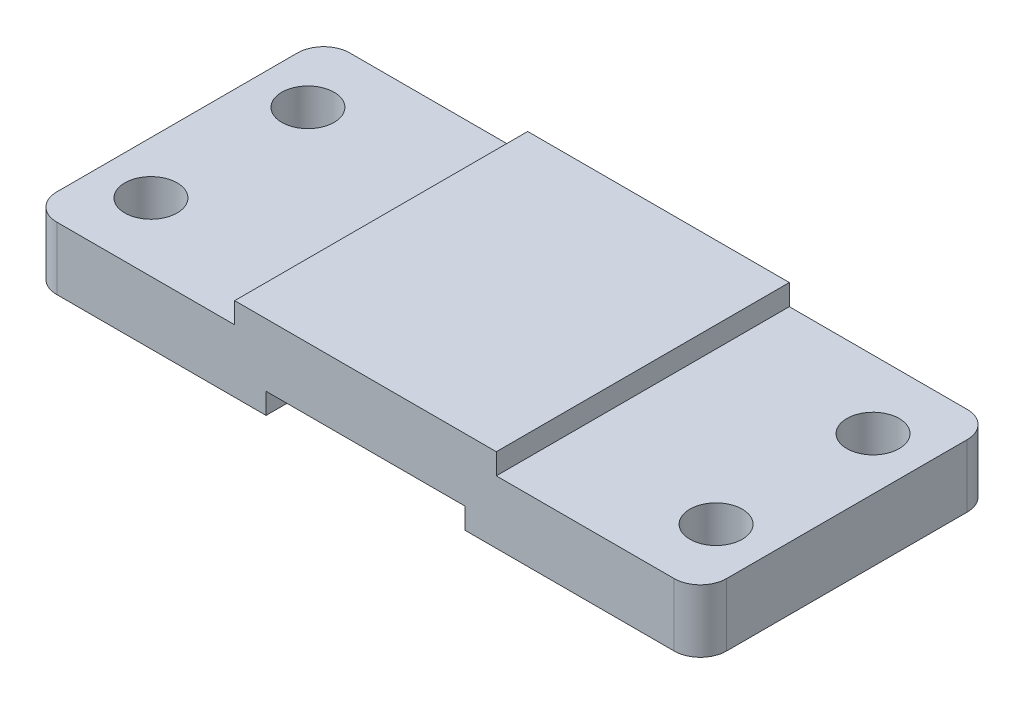
ISO-10303-21;
HEADER;
FILE_DESCRIPTION(('STEP AP214'),'2;1');
FILE_NAME('part.step','',(''),(''),'','','');
FILE_SCHEMA(('AUTOMOTIVE_DESIGN { 1 0 10303 214 1 1 1 1 }'));
ENDSEC;
DATA;
#1=APPLICATION_CONTEXT('core data for automotive mechanical design processes');
#2=APPLICATION_PROTOCOL_DEFINITION('international standard','automotive_design',2000,#1);
#3=PRODUCT_CONTEXT('',#1,'mechanical');
#4=PRODUCT('Part','Part','',(#3));
#5=PRODUCT_RELATED_PRODUCT_CATEGORY('part','',(#4));
#6=PRODUCT_DEFINITION_FORMATION('','',#4);
#7=PRODUCT_DEFINITION_CONTEXT('part definition',#1,'design');
#8=PRODUCT_DEFINITION('design','',#6,#7);
#9=PRODUCT_DEFINITION_SHAPE('','',#8);
#10=(LENGTH_UNIT() NAMED_UNIT(*) SI_UNIT(.MILLI.,.METRE.));
#11=(NAMED_UNIT(*) PLANE_ANGLE_UNIT() SI_UNIT($,.RADIAN.));
#12=(NAMED_UNIT(*) SI_UNIT($,.STERADIAN.) SOLID_ANGLE_UNIT());
#13=UNCERTAINTY_MEASURE_WITH_UNIT(LENGTH_MEASURE(1.E-05),#10,'distance_accuracy_value','');
#14=(GEOMETRIC_REPRESENTATION_CONTEXT(3) GLOBAL_UNCERTAINTY_ASSIGNED_CONTEXT((#13)) GLOBAL_UNIT_ASSIGNED_CONTEXT((#10,
#11,#12)) REPRESENTATION_CONTEXT('',''));
#15=CARTESIAN_POINT('',(0.,0.,0.));
#16=DIRECTION('',(0.,0.,1.));
#17=DIRECTION('',(1.,0.,0.));
#18=AXIS2_PLACEMENT_3D('',#15,#16,#17);
#19=CARTESIAN_POINT('',(-58.0024813895782,12.,-24.9032258064516));
#20=DIRECTION('',(1.,0.,0.));
#21=DIRECTION('',(0.,0.,-1.));
#22=AXIS2_PLACEMENT_3D('',#19,#20,#21);
#23=PLANE('',#22);
#24=DIRECTION('',(0.,1.,0.));
#25=VECTOR('',#24,1.);
#26=CARTESIAN_POINT('',(-58.0024813895782,-44.,26.0967741935484));
#27=LINE('',#26,#25);
#28=CARTESIAN_POINT('',(-58.0024813895782,0.,26.0967741935484));
#29=VERTEX_POINT('',#28);
#30=CARTESIAN_POINT('',(-58.0024813895782,12.,26.0967741935484));
#31=VERTEX_POINT('',#30);
#32=EDGE_CURVE('E169',#29,#31,#27,.T.);
#33=ORIENTED_EDGE('',*,*,#32,.T.);
#34=DIRECTION('',(0.,0.,1.));
#35=VECTOR('',#34,1.);
#36=CARTESIAN_POINT('',(-58.0024813895782,12.,-24.9032258064516));
#37=LINE('',#36,#35);
#38=CARTESIAN_POINT('',(-58.0024813895782,12.,-19.9032258064516));
#39=VERTEX_POINT('',#38);
#40=EDGE_CURVE('E165',#39,#31,#37,.T.);
#41=ORIENTED_EDGE('',*,*,#40,.F.);
#42=DIRECTION('',(0.,1.,0.));
#43=VECTOR('',#42,1.);
#44=CARTESIAN_POINT('',(-58.0024813895782,-44.,-19.9032258064516));
#45=LINE('',#44,#43);
#46=CARTESIAN_POINT('',(-58.0024813895782,0.,-19.9032258064516));
#47=VERTEX_POINT('',#46);
#48=EDGE_CURVE('E149',#47,#39,#45,.T.);
#49=ORIENTED_EDGE('',*,*,#48,.F.);
#50=DIRECTION('',(0.,0.,1.));
#51=VECTOR('',#50,1.);
#52=CARTESIAN_POINT('',(-58.0024813895782,0.,-24.9032258064516));
#53=LINE('',#52,#51);
#54=EDGE_CURVE('E190',#47,#29,#53,.T.);
#55=ORIENTED_EDGE('',*,*,#54,.T.);
#56=EDGE_LOOP('',(#33,#41,#49,#55));
#57=FACE_BOUND('',#56,.T.);
#58=ADVANCED_FACE('F39',(#57),#23,.F.);
#59=CARTESIAN_POINT('',(69.9975186104218,12.,31.0967741935484));
#60=DIRECTION('',(0.,0.,-1.));
#61=DIRECTION('',(-1.,0.,0.));
#62=AXIS2_PLACEMENT_3D('',#59,#60,#61);
#63=PLANE('',#62);
#64=DIRECTION('',(1.,0.,0.));
#65=VECTOR('',#64,1.);
#66=CARTESIAN_POINT('',(69.9975186104218,12.,31.0967741935484));
#67=LINE('',#66,#65);
#68=CARTESIAN_POINT('',(-53.0024813895782,12.,31.0967741935484));
#69=VERTEX_POINT('',#68);
#70=CARTESIAN_POINT('',(-19.0024813895782,12.,31.0967741935484));
#71=VERTEX_POINT('',#70);
#72=EDGE_CURVE('E179',#69,#71,#67,.T.);
#73=ORIENTED_EDGE('',*,*,#72,.F.);
#74=DIRECTION('',(0.,1.,0.));
#75=VECTOR('',#74,1.);
#76=CARTESIAN_POINT('',(-53.0024813895782,-44.,31.0967741935484));
#77=LINE('',#76,#75);
#78=CARTESIAN_POINT('',(-53.0024813895782,0.,31.0967741935484));
#79=VERTEX_POINT('',#78);
#80=EDGE_CURVE('E11',#69,#79,#77,.F.);
#81=ORIENTED_EDGE('',*,*,#80,.T.);
#82=DIRECTION('',(1.,0.,0.));
#83=VECTOR('',#82,1.);
#84=CARTESIAN_POINT('',(69.9975186104218,0.,31.0967741935484));
#85=LINE('',#84,#83);
#86=CARTESIAN_POINT('',(-13.0024813895782,0.,31.0967741935484));
#87=VERTEX_POINT('',#86);
#88=EDGE_CURVE('E195',#79,#87,#85,.T.);
#89=ORIENTED_EDGE('',*,*,#88,.T.);
#90=DIRECTION('',(0.,-1.,0.));
#91=VECTOR('',#90,1.);
#92=CARTESIAN_POINT('',(-13.0024813895782,0.,31.0967741935484));
#93=LINE('',#92,#91);
#94=CARTESIAN_POINT('',(-13.0024813895782,4.,31.0967741935484));
#95=VERTEX_POINT('',#94);
#96=EDGE_CURVE('E305',#95,#87,#93,.T.);
#97=ORIENTED_EDGE('',*,*,#96,.F.);
#98=DIRECTION('',(-1.,0.,0.));
#99=VECTOR('',#98,1.);
#100=CARTESIAN_POINT('',(-13.0024813895782,4.,31.0967741935484));
#101=LINE('',#100,#99);
#102=CARTESIAN_POINT('',(24.9975186104218,4.,31.0967741935484));
#103=VERTEX_POINT('',#102);
#104=EDGE_CURVE('E297',#103,#95,#101,.T.);
#105=ORIENTED_EDGE('',*,*,#104,.F.);
#106=DIRECTION('',(0.,1.,0.));
#107=VECTOR('',#106,1.);
#108=CARTESIAN_POINT('',(24.9975186104218,0.,31.0967741935484));
#109=LINE('',#108,#107);
#110=CARTESIAN_POINT('',(24.9975186104218,0.,31.0967741935484));
#111=VERTEX_POINT('',#110);
#112=EDGE_CURVE('E301',#111,#103,#109,.T.);
#113=ORIENTED_EDGE('',*,*,#112,.F.);
#114=CARTESIAN_POINT('',(64.9975186104218,0.,31.0967741935484));
#115=VERTEX_POINT('',#114);
#116=EDGE_CURVE('E193',#111,#115,#85,.T.);
#117=ORIENTED_EDGE('',*,*,#116,.T.);
#118=DIRECTION('',(0.,1.,0.));
#119=VECTOR('',#118,1.);
#120=CARTESIAN_POINT('',(64.9975186104218,-44.,31.0967741935484));
#121=LINE('',#120,#119);
#122=CARTESIAN_POINT('',(64.9975186104218,12.,31.0967741935484));
#123=VERTEX_POINT('',#122);
#124=EDGE_CURVE('E335',#115,#123,#121,.T.);
#125=ORIENTED_EDGE('',*,*,#124,.T.);
#126=CARTESIAN_POINT('',(30.9975186104218,12.,31.0967741935484));
#127=VERTEX_POINT('',#126);
#128=EDGE_CURVE('E173',#127,#123,#67,.T.);
#129=ORIENTED_EDGE('',*,*,#128,.F.);
#130=DIRECTION('',(0.,-1.,0.));
#131=VECTOR('',#130,1.);
#132=CARTESIAN_POINT('',(30.9975186104218,16.,31.0967741935484));
#133=LINE('',#132,#131);
#134=CARTESIAN_POINT('',(30.9975186104218,16.,31.0967741935484));
#135=VERTEX_POINT('',#134);
#136=EDGE_CURVE('E244',#135,#127,#133,.T.);
#137=ORIENTED_EDGE('',*,*,#136,.F.);
#138=DIRECTION('',(1.,0.,0.));
#139=VECTOR('',#138,1.);
#140=CARTESIAN_POINT('',(-19.0024813895782,16.,31.0967741935484));
#141=LINE('',#140,#139);
#142=CARTESIAN_POINT('',(-19.0024813895782,16.,31.0967741935484));
#143=VERTEX_POINT('',#142);
#144=EDGE_CURVE('E261',#143,#135,#141,.T.);
#145=ORIENTED_EDGE('',*,*,#144,.F.);
#146=DIRECTION('',(0.,-1.,0.));
#147=VECTOR('',#146,1.);
#148=CARTESIAN_POINT('',(-19.0024813895782,16.,31.0967741935484));
#149=LINE('',#148,#147);
#150=EDGE_CURVE('E194',#143,#71,#149,.T.);
#151=ORIENTED_EDGE('',*,*,#150,.T.);
#152=EDGE_LOOP('',(#73,#81,#89,#97,#105,#113,#117,#125,#129,#137,#145,#151));
#153=FACE_BOUND('',#152,.T.);
#154=ADVANCED_FACE('F375',(#153),#63,.F.);
#155=CARTESIAN_POINT('',(69.9975186104218,12.,-24.9032258064516));
#156=DIRECTION('',(-1.,0.,0.));
#157=DIRECTION('',(0.,0.,1.));
#158=AXIS2_PLACEMENT_3D('',#155,#156,#157);
#159=PLANE('',#158);
#160=DIRECTION('',(0.,1.,0.));
#161=VECTOR('',#160,1.);
#162=CARTESIAN_POINT('',(69.9975186104218,-44.,-19.9032258064516));
#163=LINE('',#162,#161);
#164=CARTESIAN_POINT('',(69.9975186104218,0.,-19.9032258064516));
#165=VERTEX_POINT('',#164);
#166=CARTESIAN_POINT('',(69.9975186104218,12.,-19.9032258064516));
#167=VERTEX_POINT('',#166);
#168=EDGE_CURVE('E349',#165,#167,#163,.T.);
#169=ORIENTED_EDGE('',*,*,#168,.T.);
#170=DIRECTION('',(0.,0.,-1.));
#171=VECTOR('',#170,1.);
#172=CARTESIAN_POINT('',(69.9975186104218,12.,-24.9032258064516));
#173=LINE('',#172,#171);
#174=CARTESIAN_POINT('',(69.9975186104218,12.,26.0967741935484));
#175=VERTEX_POINT('',#174);
#176=EDGE_CURVE('E185',#175,#167,#173,.T.);
#177=ORIENTED_EDGE('',*,*,#176,.F.);
#178=DIRECTION('',(0.,1.,0.));
#179=VECTOR('',#178,1.);
#180=CARTESIAN_POINT('',(69.9975186104218,-44.,26.0967741935484));
#181=LINE('',#180,#179);
#182=CARTESIAN_POINT('',(69.9975186104218,0.,26.0967741935484));
#183=VERTEX_POINT('',#182);
#184=EDGE_CURVE('E229',#183,#175,#181,.T.);
#185=ORIENTED_EDGE('',*,*,#184,.F.);
#186=DIRECTION('',(0.,0.,-1.));
#187=VECTOR('',#186,1.);
#188=CARTESIAN_POINT('',(69.9975186104218,0.,-24.9032258064516));
#189=LINE('',#188,#187);
#190=EDGE_CURVE('E198',#183,#165,#189,.T.);
#191=ORIENTED_EDGE('',*,*,#190,.T.);
#192=EDGE_LOOP('',(#169,#177,#185,#191));
#193=FACE_BOUND('',#192,.T.);
#194=ADVANCED_FACE('F364',(#193),#159,.F.);
#195=CARTESIAN_POINT('',(-19.0024813895782,12.,-24.9032258064516));
#196=DIRECTION('',(0.,0.,1.));
#197=DIRECTION('',(1.,0.,0.));
#198=AXIS2_PLACEMENT_3D('',#195,#196,#197);
#199=PLANE('',#198);
#200=DIRECTION('',(-1.,0.,0.));
#201=VECTOR('',#200,1.);
#202=CARTESIAN_POINT('',(-58.0024813895782,12.,-24.9032258064516));
#203=LINE('',#202,#201);
#204=CARTESIAN_POINT('',(64.9975186104218,12.,-24.9032258064516));
#205=VERTEX_POINT('',#204);
#206=CARTESIAN_POINT('',(30.9975186104218,12.,-24.9032258064516));
#207=VERTEX_POINT('',#206);
#208=EDGE_CURVE('E174',#205,#207,#203,.T.);
#209=ORIENTED_EDGE('',*,*,#208,.F.);
#210=DIRECTION('',(0.,1.,0.));
#211=VECTOR('',#210,1.);
#212=CARTESIAN_POINT('',(64.9975186104218,-44.,-24.9032258064516));
#213=LINE('',#212,#211);
#214=CARTESIAN_POINT('',(64.9975186104218,0.,-24.9032258064516));
#215=VERTEX_POINT('',#214);
#216=EDGE_CURVE('E346',#215,#205,#213,.T.);
#217=ORIENTED_EDGE('',*,*,#216,.F.);
#218=DIRECTION('',(-1.,0.,0.));
#219=VECTOR('',#218,1.);
#220=CARTESIAN_POINT('',(-19.0024813895782,0.,-24.9032258064516));
#221=LINE('',#220,#219);
#222=CARTESIAN_POINT('',(24.9975186104218,0.,-24.9032258064516));
#223=VERTEX_POINT('',#222);
#224=EDGE_CURVE('E203',#215,#223,#221,.T.);
#225=ORIENTED_EDGE('',*,*,#224,.T.);
#226=DIRECTION('',(0.,1.,0.));
#227=VECTOR('',#226,1.);
#228=CARTESIAN_POINT('',(24.9975186104218,0.,-24.9032258064516));
#229=LINE('',#228,#227);
#230=CARTESIAN_POINT('',(24.9975186104218,4.,-24.9032258064516));
#231=VERTEX_POINT('',#230);
#232=EDGE_CURVE('E291',#223,#231,#229,.T.);
#233=ORIENTED_EDGE('',*,*,#232,.T.);
#234=DIRECTION('',(-1.,0.,0.));
#235=VECTOR('',#234,1.);
#236=CARTESIAN_POINT('',(-13.0024813895782,4.,-24.9032258064516));
#237=LINE('',#236,#235);
#238=CARTESIAN_POINT('',(-13.0024813895782,4.,-24.9032258064516));
#239=VERTEX_POINT('',#238);
#240=EDGE_CURVE('E288',#231,#239,#237,.T.);
#241=ORIENTED_EDGE('',*,*,#240,.T.);
#242=DIRECTION('',(0.,-1.,0.));
#243=VECTOR('',#242,1.);
#244=CARTESIAN_POINT('',(-13.0024813895782,0.,-24.9032258064516));
#245=LINE('',#244,#243);
#246=CARTESIAN_POINT('',(-13.0024813895782,0.,-24.9032258064516));
#247=VERTEX_POINT('',#246);
#248=EDGE_CURVE('E236',#239,#247,#245,.T.);
#249=ORIENTED_EDGE('',*,*,#248,.T.);
#250=CARTESIAN_POINT('',(-53.0024813895782,0.,-24.9032258064516));
#251=VERTEX_POINT('',#250);
#252=EDGE_CURVE('E202',#247,#251,#221,.T.);
#253=ORIENTED_EDGE('',*,*,#252,.T.);
#254=DIRECTION('',(0.,1.,0.));
#255=VECTOR('',#254,1.);
#256=CARTESIAN_POINT('',(-53.0024813895782,-44.,-24.9032258064516));
#257=LINE('',#256,#255);
#258=CARTESIAN_POINT('',(-53.0024813895782,12.,-24.9032258064516));
#259=VERTEX_POINT('',#258);
#260=EDGE_CURVE('E47',#259,#251,#257,.F.);
#261=ORIENTED_EDGE('',*,*,#260,.F.);
#262=CARTESIAN_POINT('',(-19.0024813895782,12.,-24.9032258064516));
#263=VERTEX_POINT('',#262);
#264=EDGE_CURVE('E167',#263,#259,#203,.T.);
#265=ORIENTED_EDGE('',*,*,#264,.F.);
#266=DIRECTION('',(0.,-1.,0.));
#267=VECTOR('',#266,1.);
#268=CARTESIAN_POINT('',(-19.0024813895782,16.,-24.9032258064516));
#269=LINE('',#268,#267);
#270=CARTESIAN_POINT('',(-19.0024813895782,16.,-24.9032258064516));
#271=VERTEX_POINT('',#270);
#272=EDGE_CURVE('E251',#271,#263,#269,.T.);
#273=ORIENTED_EDGE('',*,*,#272,.F.);
#274=DIRECTION('',(-1.,0.,0.));
#275=VECTOR('',#274,1.);
#276=CARTESIAN_POINT('',(-19.0024813895782,16.,-24.9032258064516));
#277=LINE('',#276,#275);
#278=CARTESIAN_POINT('',(30.9975186104218,16.,-24.9032258064516));
#279=VERTEX_POINT('',#278);
#280=EDGE_CURVE('E255',#279,#271,#277,.T.);
#281=ORIENTED_EDGE('',*,*,#280,.F.);
#282=DIRECTION('',(0.,-1.,0.));
#283=VECTOR('',#282,1.);
#284=CARTESIAN_POINT('',(30.9975186104218,16.,-24.9032258064516));
#285=LINE('',#284,#283);
#286=EDGE_CURVE('E247',#279,#207,#285,.T.);
#287=ORIENTED_EDGE('',*,*,#286,.T.);
#288=EDGE_LOOP('',(#209,#217,#225,#233,#241,#249,#253,#261,#265,#273,#281,#287));
#289=FACE_BOUND('',#288,.T.);
#290=ADVANCED_FACE('F233',(#289),#199,.F.);
#291=CARTESIAN_POINT('',(0.,0.,0.));
#292=DIRECTION('',(0.,-1.,0.));
#293=DIRECTION('',(0.,0.,-1.));
#294=AXIS2_PLACEMENT_3D('',#291,#292,#293);
#295=PLANE('',#294);
#296=CARTESIAN_POINT('',(-53.0024813895782,0.,26.0967741935484));
#297=DIRECTION('',(0.,-1.,0.));
#298=DIRECTION('',(0.,0.,-1.));
#299=AXIS2_PLACEMENT_3D('',#296,#297,#298);
#300=CIRCLE('',#299,5.);
#301=EDGE_CURVE('E54',#29,#79,#300,.F.);
#302=ORIENTED_EDGE('',*,*,#301,.F.);
#303=ORIENTED_EDGE('',*,*,#54,.F.);
#304=CARTESIAN_POINT('',(-53.0024813895782,0.,-19.9032258064516));
#305=DIRECTION('',(0.,-1.,0.));
#306=DIRECTION('',(0.,0.,-1.));
#307=AXIS2_PLACEMENT_3D('',#304,#305,#306);
#308=CIRCLE('',#307,5.);
#309=EDGE_CURVE('E152',#251,#47,#308,.F.);
#310=ORIENTED_EDGE('',*,*,#309,.F.);
#311=ORIENTED_EDGE('',*,*,#252,.F.);
#312=DIRECTION('',(0.,0.,1.));
#313=VECTOR('',#312,1.);
#314=CARTESIAN_POINT('',(-13.0024813895782,0.,-24.9032258064516));
#315=LINE('',#314,#313);
#316=EDGE_CURVE('E285',#247,#87,#315,.T.);
#317=ORIENTED_EDGE('',*,*,#316,.T.);
#318=ORIENTED_EDGE('',*,*,#88,.F.);
#319=EDGE_LOOP('',(#302,#303,#310,#311,#317,#318));
#320=FACE_BOUND('',#319,.T.);
#321=CARTESIAN_POINT('',(-48.0024813895782,0.,18.0967741935484));
#322=DIRECTION('',(0.,-1.,0.));
#323=DIRECTION('',(0.,0.,-1.));
#324=AXIS2_PLACEMENT_3D('',#321,#322,#323);
#325=CIRCLE('',#324,5.);
#326=CARTESIAN_POINT('',(-48.0024813895782,0.,13.0967741935484));
#327=VERTEX_POINT('',#326);
#328=EDGE_CURVE('E309',#327,#327,#325,.T.);
#329=ORIENTED_EDGE('',*,*,#328,.F.);
#330=EDGE_LOOP('',(#329));
#331=FACE_BOUND('',#330,.T.);
#332=CARTESIAN_POINT('',(-48.0024813895782,0.,-11.9032258064516));
#333=DIRECTION('',(0.,-1.,0.));
#334=DIRECTION('',(0.,0.,-1.));
#335=AXIS2_PLACEMENT_3D('',#332,#333,#334);
#336=CIRCLE('',#335,5.);
#337=CARTESIAN_POINT('',(-48.0024813895782,0.,-16.9032258064516));
#338=VERTEX_POINT('',#337);
#339=EDGE_CURVE('E215',#338,#338,#336,.T.);
#340=ORIENTED_EDGE('',*,*,#339,.F.);
#341=EDGE_LOOP('',(#340));
#342=FACE_BOUND('',#341,.T.);
#343=ADVANCED_FACE('F225',(#320,#331,#342),#295,.T.);
#344=CARTESIAN_POINT('',(0.,12.,0.));
#345=DIRECTION('',(0.,-1.,0.));
#346=DIRECTION('',(0.,0.,-1.));
#347=AXIS2_PLACEMENT_3D('',#344,#345,#346);
#348=PLANE('',#347);
#349=CARTESIAN_POINT('',(-48.0024813895782,12.,18.0967741935484));
#350=DIRECTION('',(0.,1.,0.));
#351=DIRECTION('',(0.,0.,-1.));
#352=AXIS2_PLACEMENT_3D('',#349,#350,#351);
#353=CIRCLE('',#352,5.);
#354=CARTESIAN_POINT('',(-48.0024813895782,12.,13.0967741935484));
#355=VERTEX_POINT('',#354);
#356=EDGE_CURVE('E327',#355,#355,#353,.T.);
#357=ORIENTED_EDGE('',*,*,#356,.F.);
#358=EDGE_LOOP('',(#357));
#359=FACE_BOUND('',#358,.T.);
#360=CARTESIAN_POINT('',(-48.0024813895782,12.,-11.9032258064516));
#361=DIRECTION('',(0.,1.,0.));
#362=DIRECTION('',(0.,0.,1.));
#363=AXIS2_PLACEMENT_3D('',#360,#361,#362);
#364=CIRCLE('',#363,5.);
#365=CARTESIAN_POINT('',(-48.0024813895782,12.,-6.90322580645161));
#366=VERTEX_POINT('',#365);
#367=EDGE_CURVE('E211',#366,#366,#364,.T.);
#368=ORIENTED_EDGE('',*,*,#367,.F.);
#369=EDGE_LOOP('',(#368));
#370=FACE_BOUND('',#369,.T.);
#371=ORIENTED_EDGE('',*,*,#40,.T.);
#372=CARTESIAN_POINT('',(-53.0024813895782,12.,26.0967741935484));
#373=DIRECTION('',(0.,-1.,0.));
#374=DIRECTION('',(0.,0.,-1.));
#375=AXIS2_PLACEMENT_3D('',#372,#373,#374);
#376=CIRCLE('',#375,5.);
#377=EDGE_CURVE('E343',#69,#31,#376,.T.);
#378=ORIENTED_EDGE('',*,*,#377,.F.);
#379=ORIENTED_EDGE('',*,*,#72,.T.);
#380=DIRECTION('',(0.,0.,1.));
#381=VECTOR('',#380,1.);
#382=CARTESIAN_POINT('',(-19.0024813895782,12.,-24.9032258064516));
#383=LINE('',#382,#381);
#384=EDGE_CURVE('E272',#263,#71,#383,.T.);
#385=ORIENTED_EDGE('',*,*,#384,.F.);
#386=ORIENTED_EDGE('',*,*,#264,.T.);
#387=CARTESIAN_POINT('',(-53.0024813895782,12.,-19.9032258064516));
#388=DIRECTION('',(0.,-1.,0.));
#389=DIRECTION('',(0.,0.,1.));
#390=AXIS2_PLACEMENT_3D('',#387,#388,#389);
#391=CIRCLE('',#390,5.);
#392=EDGE_CURVE('E61',#39,#259,#391,.T.);
#393=ORIENTED_EDGE('',*,*,#392,.F.);
#394=EDGE_LOOP('',(#371,#378,#379,#385,#386,#393));
#395=FACE_BOUND('',#394,.T.);
#396=ADVANCED_FACE('F163',(#359,#370,#395),#348,.F.);
#397=CARTESIAN_POINT('',(59.9975186104218,12.,-11.9032258064516));
#398=DIRECTION('',(0.,1.,0.));
#399=DIRECTION('',(0.,0.,-1.));
#400=AXIS2_PLACEMENT_3D('',#397,#398,#399);
#401=CIRCLE('',#400,5.);
#402=CARTESIAN_POINT('',(59.9975186104218,12.,-16.9032258064516));
#403=VERTEX_POINT('',#402);
#404=EDGE_CURVE('E323',#403,#403,#401,.T.);
#405=ORIENTED_EDGE('',*,*,#404,.F.);
#406=EDGE_LOOP('',(#405));
#407=FACE_BOUND('',#406,.T.);
#408=CARTESIAN_POINT('',(59.9975186104218,12.,18.0967741935484));
#409=DIRECTION('',(0.,1.,0.));
#410=DIRECTION('',(0.,0.,1.));
#411=AXIS2_PLACEMENT_3D('',#408,#409,#410);
#412=CIRCLE('',#411,5.);
#413=CARTESIAN_POINT('',(59.9975186104218,12.,23.0967741935484));
#414=VERTEX_POINT('',#413);
#415=EDGE_CURVE('E319',#414,#414,#412,.T.);
#416=ORIENTED_EDGE('',*,*,#415,.F.);
#417=EDGE_LOOP('',(#416));
#418=FACE_BOUND('',#417,.T.);
#419=ORIENTED_EDGE('',*,*,#176,.T.);
#420=CARTESIAN_POINT('',(64.9975186104218,12.,-19.9032258064516));
#421=DIRECTION('',(0.,-1.,0.));
#422=DIRECTION('',(0.,0.,-1.));
#423=AXIS2_PLACEMENT_3D('',#420,#421,#422);
#424=CIRCLE('',#423,4.99999999999999);
#425=EDGE_CURVE('E353',#205,#167,#424,.T.);
#426=ORIENTED_EDGE('',*,*,#425,.F.);
#427=ORIENTED_EDGE('',*,*,#208,.T.);
#428=DIRECTION('',(0.,0.,-1.));
#429=VECTOR('',#428,1.);
#430=CARTESIAN_POINT('',(30.9975186104218,12.,31.0967741935484));
#431=LINE('',#430,#429);
#432=EDGE_CURVE('E268',#127,#207,#431,.T.);
#433=ORIENTED_EDGE('',*,*,#432,.F.);
#434=ORIENTED_EDGE('',*,*,#128,.T.);
#435=CARTESIAN_POINT('',(64.9975186104218,12.,26.0967741935484));
#436=DIRECTION('',(0.,-1.,0.));
#437=DIRECTION('',(0.,0.,1.));
#438=AXIS2_PLACEMENT_3D('',#435,#436,#437);
#439=CIRCLE('',#438,4.99999999999999);
#440=EDGE_CURVE('E158',#175,#123,#439,.T.);
#441=ORIENTED_EDGE('',*,*,#440,.F.);
#442=EDGE_LOOP('',(#419,#426,#427,#433,#434,#441));
#443=FACE_BOUND('',#442,.T.);
#444=ADVANCED_FACE('F368',(#407,#418,#443),#348,.F.);
#445=CARTESIAN_POINT('',(64.9975186104218,0.,-19.9032258064516));
#446=DIRECTION('',(0.,-1.,0.));
#447=DIRECTION('',(0.,0.,-1.));
#448=AXIS2_PLACEMENT_3D('',#445,#446,#447);
#449=CIRCLE('',#448,4.99999999999999);
#450=EDGE_CURVE('E218',#165,#215,#449,.F.);
#451=ORIENTED_EDGE('',*,*,#450,.F.);
#452=ORIENTED_EDGE('',*,*,#190,.F.);
#453=CARTESIAN_POINT('',(64.9975186104218,0.,26.0967741935484));
#454=DIRECTION('',(0.,-1.,0.));
#455=DIRECTION('',(0.,0.,-1.));
#456=AXIS2_PLACEMENT_3D('',#453,#454,#455);
#457=CIRCLE('',#456,4.99999999999999);
#458=EDGE_CURVE('E189',#115,#183,#457,.F.);
#459=ORIENTED_EDGE('',*,*,#458,.F.);
#460=ORIENTED_EDGE('',*,*,#116,.F.);
#461=DIRECTION('',(0.,0.,1.));
#462=VECTOR('',#461,1.);
#463=CARTESIAN_POINT('',(24.9975186104218,0.,-24.9032258064516));
#464=LINE('',#463,#462);
#465=EDGE_CURVE('E282',#223,#111,#464,.T.);
#466=ORIENTED_EDGE('',*,*,#465,.F.);
#467=ORIENTED_EDGE('',*,*,#224,.F.);
#468=EDGE_LOOP('',(#451,#452,#459,#460,#466,#467));
#469=FACE_BOUND('',#468,.T.);
#470=CARTESIAN_POINT('',(59.9975186104218,0.,-11.9032258064516));
#471=DIRECTION('',(0.,-1.,0.));
#472=DIRECTION('',(0.,0.,-1.));
#473=AXIS2_PLACEMENT_3D('',#470,#471,#472);
#474=CIRCLE('',#473,5.);
#475=CARTESIAN_POINT('',(59.9975186104218,0.,-16.9032258064516));
#476=VERTEX_POINT('',#475);
#477=EDGE_CURVE('E210',#476,#476,#474,.T.);
#478=ORIENTED_EDGE('',*,*,#477,.F.);
#479=EDGE_LOOP('',(#478));
#480=FACE_BOUND('',#479,.T.);
#481=CARTESIAN_POINT('',(59.9975186104218,0.,18.0967741935484));
#482=DIRECTION('',(0.,-1.,0.));
#483=DIRECTION('',(0.,0.,-1.));
#484=AXIS2_PLACEMENT_3D('',#481,#482,#483);
#485=CIRCLE('',#484,5.);
#486=CARTESIAN_POINT('',(59.9975186104218,0.,13.0967741935484));
#487=VERTEX_POINT('',#486);
#488=EDGE_CURVE('E206',#487,#487,#485,.T.);
#489=ORIENTED_EDGE('',*,*,#488,.F.);
#490=EDGE_LOOP('',(#489));
#491=FACE_BOUND('',#490,.T.);
#492=ADVANCED_FACE('F382',(#469,#480,#491),#295,.T.);
#493=CARTESIAN_POINT('',(-19.0024813895782,16.,-24.9032258064516));
#494=DIRECTION('',(1.,0.,0.));
#495=DIRECTION('',(0.,0.,-1.));
#496=AXIS2_PLACEMENT_3D('',#493,#494,#495);
#497=PLANE('',#496);
#498=ORIENTED_EDGE('',*,*,#384,.T.);
#499=ORIENTED_EDGE('',*,*,#150,.F.);
#500=DIRECTION('',(0.,0.,1.));
#501=VECTOR('',#500,1.);
#502=CARTESIAN_POINT('',(-19.0024813895782,16.,-24.9032258064516));
#503=LINE('',#502,#501);
#504=EDGE_CURVE('E264',#271,#143,#503,.T.);
#505=ORIENTED_EDGE('',*,*,#504,.F.);
#506=ORIENTED_EDGE('',*,*,#272,.T.);
#507=EDGE_LOOP('',(#498,#499,#505,#506));
#508=FACE_BOUND('',#507,.T.);
#509=ADVANCED_FACE('F397',(#508),#497,.F.);
#510=CARTESIAN_POINT('',(30.9975186104218,16.,31.0967741935484));
#511=DIRECTION('',(-1.,0.,0.));
#512=DIRECTION('',(0.,0.,1.));
#513=AXIS2_PLACEMENT_3D('',#510,#511,#512);
#514=PLANE('',#513);
#515=ORIENTED_EDGE('',*,*,#432,.T.);
#516=ORIENTED_EDGE('',*,*,#286,.F.);
#517=DIRECTION('',(0.,0.,-1.));
#518=VECTOR('',#517,1.);
#519=CARTESIAN_POINT('',(30.9975186104218,16.,31.0967741935484));
#520=LINE('',#519,#518);
#521=EDGE_CURVE('E258',#135,#279,#520,.T.);
#522=ORIENTED_EDGE('',*,*,#521,.F.);
#523=ORIENTED_EDGE('',*,*,#136,.T.);
#524=EDGE_LOOP('',(#515,#516,#522,#523));
#525=FACE_BOUND('',#524,.T.);
#526=ADVANCED_FACE('F389',(#525),#514,.F.);
#527=CARTESIAN_POINT('',(0.,16.,0.));
#528=DIRECTION('',(0.,1.,0.));
#529=DIRECTION('',(0.,0.,1.));
#530=AXIS2_PLACEMENT_3D('',#527,#528,#529);
#531=PLANE('',#530);
#532=ORIENTED_EDGE('',*,*,#504,.T.);
#533=ORIENTED_EDGE('',*,*,#144,.T.);
#534=ORIENTED_EDGE('',*,*,#521,.T.);
#535=ORIENTED_EDGE('',*,*,#280,.T.);
#536=EDGE_LOOP('',(#532,#533,#534,#535));
#537=FACE_BOUND('',#536,.T.);
#538=ADVANCED_FACE('F394',(#537),#531,.T.);
#539=CARTESIAN_POINT('',(-13.0024813895782,0.,-24.9032258064516));
#540=DIRECTION('',(-1.,0.,0.));
#541=DIRECTION('',(0.,0.,1.));
#542=AXIS2_PLACEMENT_3D('',#539,#540,#541);
#543=PLANE('',#542);
#544=ORIENTED_EDGE('',*,*,#96,.T.);
#545=ORIENTED_EDGE('',*,*,#316,.F.);
#546=ORIENTED_EDGE('',*,*,#248,.F.);
#547=DIRECTION('',(0.,0.,1.));
#548=VECTOR('',#547,1.);
#549=CARTESIAN_POINT('',(-13.0024813895782,4.,-24.9032258064516));
#550=LINE('',#549,#548);
#551=EDGE_CURVE('E276',#239,#95,#550,.T.);
#552=ORIENTED_EDGE('',*,*,#551,.T.);
#553=EDGE_LOOP('',(#544,#545,#546,#552));
#554=FACE_BOUND('',#553,.T.);
#555=ADVANCED_FACE('F401',(#554),#543,.F.);
#556=CARTESIAN_POINT('',(-13.0024813895782,4.,-24.9032258064516));
#557=DIRECTION('',(0.,1.,0.));
#558=DIRECTION('',(0.,0.,1.));
#559=AXIS2_PLACEMENT_3D('',#556,#557,#558);
#560=PLANE('',#559);
#561=ORIENTED_EDGE('',*,*,#104,.T.);
#562=ORIENTED_EDGE('',*,*,#551,.F.);
#563=ORIENTED_EDGE('',*,*,#240,.F.);
#564=DIRECTION('',(0.,0.,1.));
#565=VECTOR('',#564,1.);
#566=CARTESIAN_POINT('',(24.9975186104218,4.,-24.9032258064516));
#567=LINE('',#566,#565);
#568=EDGE_CURVE('E279',#231,#103,#567,.T.);
#569=ORIENTED_EDGE('',*,*,#568,.T.);
#570=EDGE_LOOP('',(#561,#562,#563,#569));
#571=FACE_BOUND('',#570,.T.);
#572=ADVANCED_FACE('F403',(#571),#560,.F.);
#573=CARTESIAN_POINT('',(24.9975186104218,0.,-24.9032258064516));
#574=DIRECTION('',(1.,0.,0.));
#575=DIRECTION('',(0.,0.,-1.));
#576=AXIS2_PLACEMENT_3D('',#573,#574,#575);
#577=PLANE('',#576);
#578=ORIENTED_EDGE('',*,*,#112,.T.);
#579=ORIENTED_EDGE('',*,*,#568,.F.);
#580=ORIENTED_EDGE('',*,*,#232,.F.);
#581=ORIENTED_EDGE('',*,*,#465,.T.);
#582=EDGE_LOOP('',(#578,#579,#580,#581));
#583=FACE_BOUND('',#582,.T.);
#584=ADVANCED_FACE('F406',(#583),#577,.F.);
#585=CARTESIAN_POINT('',(59.9975186104218,-44.,18.0967741935484));
#586=DIRECTION('',(0.,1.,0.));
#587=DIRECTION('',(0.,0.,1.));
#588=AXIS2_PLACEMENT_3D('',#585,#586,#587);
#589=CYLINDRICAL_SURFACE('',#588,5.);
#590=ORIENTED_EDGE('',*,*,#488,.T.);
#591=EDGE_LOOP('',(#590));
#592=FACE_BOUND('',#591,.T.);
#593=ORIENTED_EDGE('',*,*,#415,.T.);
#594=EDGE_LOOP('',(#593));
#595=FACE_BOUND('',#594,.T.);
#596=ADVANCED_FACE('F408',(#592,#595),#589,.F.);
#597=CARTESIAN_POINT('',(59.9975186104218,-44.,-11.9032258064516));
#598=DIRECTION('',(0.,1.,0.));
#599=DIRECTION('',(0.,0.,1.));
#600=AXIS2_PLACEMENT_3D('',#597,#598,#599);
#601=CYLINDRICAL_SURFACE('',#600,5.);
#602=ORIENTED_EDGE('',*,*,#477,.T.);
#603=EDGE_LOOP('',(#602));
#604=FACE_BOUND('',#603,.T.);
#605=ORIENTED_EDGE('',*,*,#404,.T.);
#606=EDGE_LOOP('',(#605));
#607=FACE_BOUND('',#606,.T.);
#608=ADVANCED_FACE('F414',(#604,#607),#601,.F.);
#609=CARTESIAN_POINT('',(-48.0024813895782,-44.,-11.9032258064516));
#610=DIRECTION('',(0.,1.,0.));
#611=DIRECTION('',(0.,0.,1.));
#612=AXIS2_PLACEMENT_3D('',#609,#610,#611);
#613=CYLINDRICAL_SURFACE('',#612,5.);
#614=ORIENTED_EDGE('',*,*,#339,.T.);
#615=EDGE_LOOP('',(#614));
#616=FACE_BOUND('',#615,.T.);
#617=ORIENTED_EDGE('',*,*,#367,.T.);
#618=EDGE_LOOP('',(#617));
#619=FACE_BOUND('',#618,.T.);
#620=ADVANCED_FACE('F468',(#616,#619),#613,.F.);
#621=CARTESIAN_POINT('',(-48.0024813895782,-44.,18.0967741935484));
#622=DIRECTION('',(0.,1.,0.));
#623=DIRECTION('',(0.,0.,1.));
#624=AXIS2_PLACEMENT_3D('',#621,#622,#623);
#625=CYLINDRICAL_SURFACE('',#624,5.);
#626=ORIENTED_EDGE('',*,*,#328,.T.);
#627=EDGE_LOOP('',(#626));
#628=FACE_BOUND('',#627,.T.);
#629=ORIENTED_EDGE('',*,*,#356,.T.);
#630=EDGE_LOOP('',(#629));
#631=FACE_BOUND('',#630,.T.);
#632=ADVANCED_FACE('F478',(#628,#631),#625,.F.);
#633=CARTESIAN_POINT('',(64.9975186104218,-44.,26.0967741935484));
#634=DIRECTION('',(0.,1.,0.));
#635=DIRECTION('',(0.,0.,1.));
#636=AXIS2_PLACEMENT_3D('',#633,#634,#635);
#637=CYLINDRICAL_SURFACE('',#636,4.99999999999999);
#638=ORIENTED_EDGE('',*,*,#458,.T.);
#639=ORIENTED_EDGE('',*,*,#184,.T.);
#640=ORIENTED_EDGE('',*,*,#440,.T.);
#641=ORIENTED_EDGE('',*,*,#124,.F.);
#642=EDGE_LOOP('',(#638,#639,#640,#641));
#643=FACE_BOUND('',#642,.T.);
#644=ADVANCED_FACE('F371',(#643),#637,.T.);
#645=CARTESIAN_POINT('',(64.9975186104218,-44.,-19.9032258064516));
#646=DIRECTION('',(0.,1.,0.));
#647=DIRECTION('',(0.,0.,1.));
#648=AXIS2_PLACEMENT_3D('',#645,#646,#647);
#649=CYLINDRICAL_SURFACE('',#648,4.99999999999999);
#650=ORIENTED_EDGE('',*,*,#450,.T.);
#651=ORIENTED_EDGE('',*,*,#216,.T.);
#652=ORIENTED_EDGE('',*,*,#425,.T.);
#653=ORIENTED_EDGE('',*,*,#168,.F.);
#654=EDGE_LOOP('',(#650,#651,#652,#653));
#655=FACE_BOUND('',#654,.T.);
#656=ADVANCED_FACE('F358',(#655),#649,.T.);
#657=CARTESIAN_POINT('',(-53.0024813895782,-44.,-19.9032258064516));
#658=DIRECTION('',(0.,1.,0.));
#659=DIRECTION('',(0.,0.,1.));
#660=AXIS2_PLACEMENT_3D('',#657,#658,#659);
#661=CYLINDRICAL_SURFACE('',#660,5.);
#662=ORIENTED_EDGE('',*,*,#309,.T.);
#663=ORIENTED_EDGE('',*,*,#48,.T.);
#664=ORIENTED_EDGE('',*,*,#392,.T.);
#665=ORIENTED_EDGE('',*,*,#260,.T.);
#666=EDGE_LOOP('',(#662,#663,#664,#665));
#667=FACE_BOUND('',#666,.T.);
#668=ADVANCED_FACE('F150',(#667),#661,.T.);
#669=CARTESIAN_POINT('',(-53.0024813895782,-44.,26.0967741935484));
#670=DIRECTION('',(0.,1.,0.));
#671=DIRECTION('',(0.,0.,1.));
#672=AXIS2_PLACEMENT_3D('',#669,#670,#671);
#673=CYLINDRICAL_SURFACE('',#672,5.);
#674=ORIENTED_EDGE('',*,*,#301,.T.);
#675=ORIENTED_EDGE('',*,*,#80,.F.);
#676=ORIENTED_EDGE('',*,*,#377,.T.);
#677=ORIENTED_EDGE('',*,*,#32,.F.);
#678=EDGE_LOOP('',(#674,#675,#676,#677));
#679=FACE_BOUND('',#678,.T.);
#680=ADVANCED_FACE('F565',(#679),#673,.T.);
#681=CLOSED_SHELL('',(#58,#154,#194,#290,#343,#396,#444,#492,#509,#526,#538,#555,#572,#584,#596,
#608,#620,#632,#644,#656,#668,#680));
#682=MANIFOLD_SOLID_BREP('B2',#681);
#683=ADVANCED_BREP_SHAPE_REPRESENTATION('',(#18,#682),#14);
#684=SHAPE_DEFINITION_REPRESENTATION(#9,#683);
ENDSEC;
END-ISO-10303-21;
